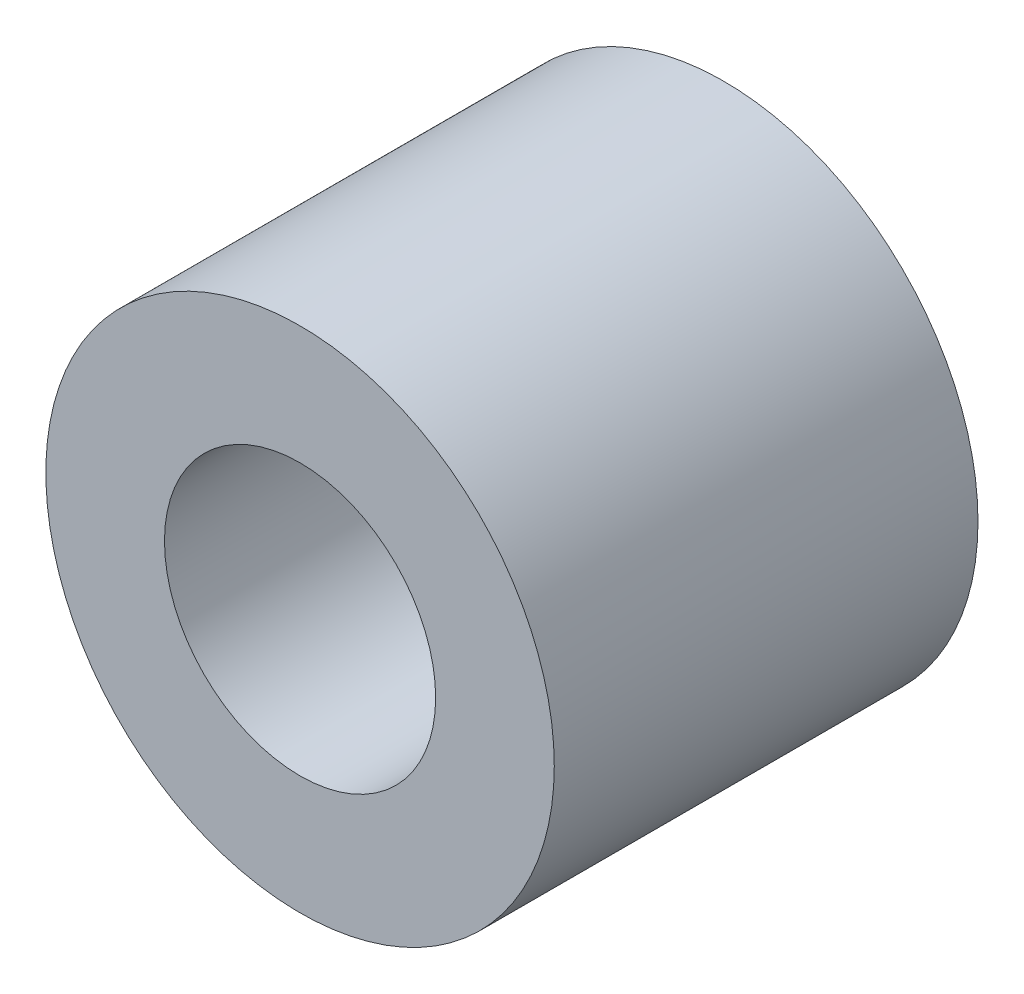
ISO-10303-21;
HEADER;
FILE_DESCRIPTION(('STEP AP214'),'2;1');
FILE_NAME('part.step','',(''),(''),'','','');
FILE_SCHEMA(('AUTOMOTIVE_DESIGN { 1 0 10303 214 1 1 1 1 }'));
ENDSEC;
DATA;
#1=APPLICATION_CONTEXT('core data for automotive mechanical design processes');
#2=APPLICATION_PROTOCOL_DEFINITION('international standard','automotive_design',2000,#1);
#3=PRODUCT_CONTEXT('',#1,'mechanical');
#4=PRODUCT('Part','Part','',(#3));
#5=PRODUCT_RELATED_PRODUCT_CATEGORY('part','',(#4));
#6=PRODUCT_DEFINITION_FORMATION('','',#4);
#7=PRODUCT_DEFINITION_CONTEXT('part definition',#1,'design');
#8=PRODUCT_DEFINITION('design','',#6,#7);
#9=PRODUCT_DEFINITION_SHAPE('','',#8);
#10=(LENGTH_UNIT() NAMED_UNIT(*) SI_UNIT(.MILLI.,.METRE.));
#11=(NAMED_UNIT(*) PLANE_ANGLE_UNIT() SI_UNIT($,.RADIAN.));
#12=(NAMED_UNIT(*) SI_UNIT($,.STERADIAN.) SOLID_ANGLE_UNIT());
#13=UNCERTAINTY_MEASURE_WITH_UNIT(LENGTH_MEASURE(1.E-05),#10,'distance_accuracy_value','');
#14=(GEOMETRIC_REPRESENTATION_CONTEXT(3) GLOBAL_UNCERTAINTY_ASSIGNED_CONTEXT((#13)) GLOBAL_UNIT_ASSIGNED_CONTEXT((#10,
#11,#12)) REPRESENTATION_CONTEXT('',''));
#15=CARTESIAN_POINT('',(0.,0.,0.));
#16=DIRECTION('',(0.,0.,1.));
#17=DIRECTION('',(1.,0.,0.));
#18=AXIS2_PLACEMENT_3D('',#15,#16,#17);
#19=CARTESIAN_POINT('',(0.,0.,5.));
#20=DIRECTION('',(0.,0.,1.));
#21=DIRECTION('',(1.,0.,0.));
#22=AXIS2_PLACEMENT_3D('',#19,#20,#21);
#23=PLANE('',#22);
#24=CARTESIAN_POINT('',(0.,0.,5.));
#25=DIRECTION('',(0.,0.,1.));
#26=DIRECTION('',(1.,0.,0.));
#27=AXIS2_PLACEMENT_3D('',#24,#25,#26);
#28=CIRCLE('',#27,3.);
#29=CARTESIAN_POINT('',(3.,0.,5.));
#30=VERTEX_POINT('',#29);
#31=EDGE_CURVE('E10',#30,#30,#28,.T.);
#32=ORIENTED_EDGE('',*,*,#31,.T.);
#33=EDGE_LOOP('',(#32));
#34=FACE_BOUND('',#33,.T.);
#35=CARTESIAN_POINT('',(0.,0.,5.));
#36=DIRECTION('',(0.,0.,1.));
#37=DIRECTION('',(1.,0.,0.));
#38=AXIS2_PLACEMENT_3D('',#35,#36,#37);
#39=CIRCLE('',#38,1.6);
#40=CARTESIAN_POINT('',(1.6,0.,5.));
#41=VERTEX_POINT('',#40);
#42=EDGE_CURVE('E46',#41,#41,#39,.T.);
#43=ORIENTED_EDGE('',*,*,#42,.F.);
#44=EDGE_LOOP('',(#43));
#45=FACE_BOUND('',#44,.T.);
#46=ADVANCED_FACE('F35',(#34,#45),#23,.T.);
#47=CARTESIAN_POINT('',(0.,0.,0.));
#48=DIRECTION('',(0.,0.,1.));
#49=DIRECTION('',(1.,0.,0.));
#50=AXIS2_PLACEMENT_3D('',#47,#48,#49);
#51=PLANE('',#50);
#52=CARTESIAN_POINT('',(0.,0.,0.));
#53=DIRECTION('',(0.,0.,1.));
#54=DIRECTION('',(1.,0.,0.));
#55=AXIS2_PLACEMENT_3D('',#52,#53,#54);
#56=CIRCLE('',#55,3.);
#57=CARTESIAN_POINT('',(3.,0.,0.));
#58=VERTEX_POINT('',#57);
#59=EDGE_CURVE('E39',#58,#58,#56,.T.);
#60=ORIENTED_EDGE('',*,*,#59,.F.);
#61=EDGE_LOOP('',(#60));
#62=FACE_BOUND('',#61,.T.);
#63=CARTESIAN_POINT('',(0.,0.,0.));
#64=DIRECTION('',(0.,0.,1.));
#65=DIRECTION('',(1.,0.,0.));
#66=AXIS2_PLACEMENT_3D('',#63,#64,#65);
#67=CIRCLE('',#66,1.6);
#68=CARTESIAN_POINT('',(1.6,0.,0.));
#69=VERTEX_POINT('',#68);
#70=EDGE_CURVE('E48',#69,#69,#67,.T.);
#71=ORIENTED_EDGE('',*,*,#70,.T.);
#72=EDGE_LOOP('',(#71));
#73=FACE_BOUND('',#72,.T.);
#74=ADVANCED_FACE('F58',(#62,#73),#51,.F.);
#75=CARTESIAN_POINT('',(0.,0.,5.));
#76=DIRECTION('',(0.,0.,-1.));
#77=DIRECTION('',(-1.,0.,0.));
#78=AXIS2_PLACEMENT_3D('',#75,#76,#77);
#79=CYLINDRICAL_SURFACE('',#78,3.);
#80=ORIENTED_EDGE('',*,*,#31,.F.);
#81=EDGE_LOOP('',(#80));
#82=FACE_BOUND('',#81,.T.);
#83=ORIENTED_EDGE('',*,*,#59,.T.);
#84=EDGE_LOOP('',(#83));
#85=FACE_BOUND('',#84,.T.);
#86=ADVANCED_FACE('F37',(#82,#85),#79,.T.);
#87=CARTESIAN_POINT('',(0.,0.,5.));
#88=DIRECTION('',(0.,0.,-1.));
#89=DIRECTION('',(-1.,0.,0.));
#90=AXIS2_PLACEMENT_3D('',#87,#88,#89);
#91=CYLINDRICAL_SURFACE('',#90,1.6);
#92=ORIENTED_EDGE('',*,*,#42,.T.);
#93=EDGE_LOOP('',(#92));
#94=FACE_BOUND('',#93,.T.);
#95=ORIENTED_EDGE('',*,*,#70,.F.);
#96=EDGE_LOOP('',(#95));
#97=FACE_BOUND('',#96,.T.);
#98=ADVANCED_FACE('F54',(#94,#97),#91,.F.);
#99=CLOSED_SHELL('',(#46,#74,#86,#98));
#100=MANIFOLD_SOLID_BREP('B2',#99);
#101=ADVANCED_BREP_SHAPE_REPRESENTATION('',(#18,#100),#14);
#102=SHAPE_DEFINITION_REPRESENTATION(#9,#101);
ENDSEC;
END-ISO-10303-21;
